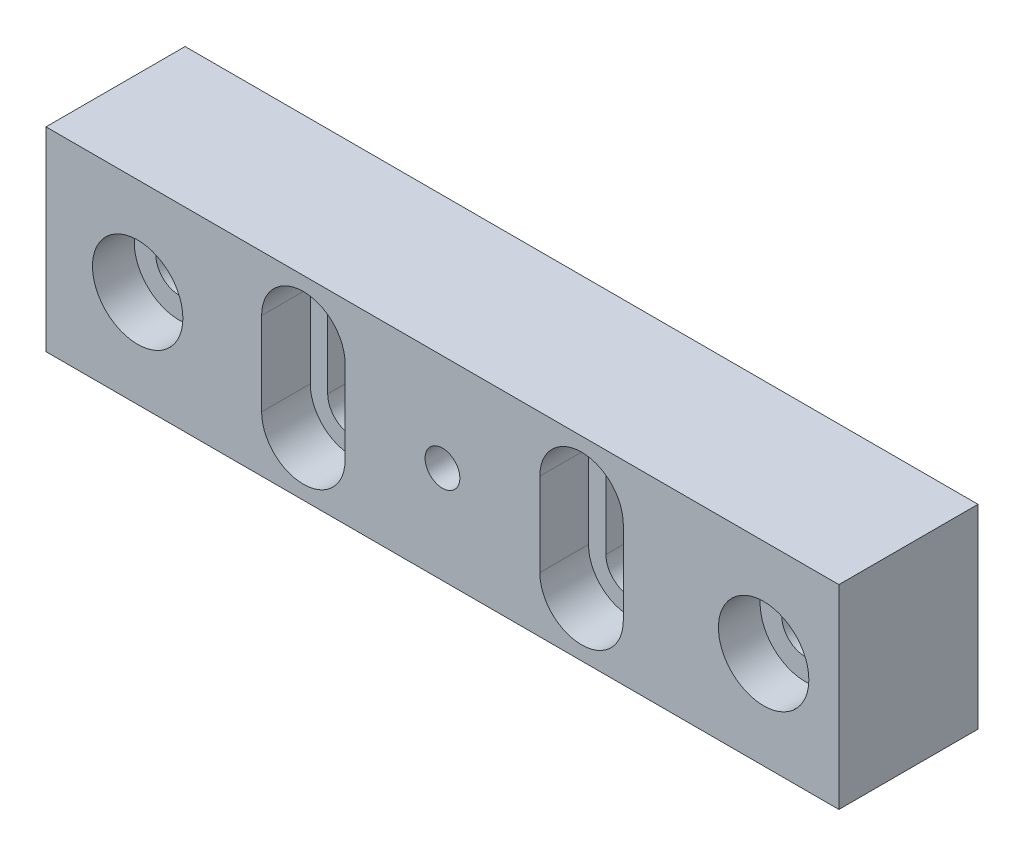
ISO-10303-21;
HEADER;
FILE_DESCRIPTION(('STEP AP214'),'2;1');
FILE_NAME('part.step','',(''),(''),'','','');
FILE_SCHEMA(('AUTOMOTIVE_DESIGN { 1 0 10303 214 1 1 1 1 }'));
ENDSEC;
DATA;
#1=APPLICATION_CONTEXT('core data for automotive mechanical design processes');
#2=APPLICATION_PROTOCOL_DEFINITION('international standard','automotive_design',2000,#1);
#3=PRODUCT_CONTEXT('',#1,'mechanical');
#4=PRODUCT('Part','Part','',(#3));
#5=PRODUCT_RELATED_PRODUCT_CATEGORY('part','',(#4));
#6=PRODUCT_DEFINITION_FORMATION('','',#4);
#7=PRODUCT_DEFINITION_CONTEXT('part definition',#1,'design');
#8=PRODUCT_DEFINITION('design','',#6,#7);
#9=PRODUCT_DEFINITION_SHAPE('','',#8);
#10=(LENGTH_UNIT() NAMED_UNIT(*) SI_UNIT(.MILLI.,.METRE.));
#11=(NAMED_UNIT(*) PLANE_ANGLE_UNIT() SI_UNIT($,.RADIAN.));
#12=(NAMED_UNIT(*) SI_UNIT($,.STERADIAN.) SOLID_ANGLE_UNIT());
#13=UNCERTAINTY_MEASURE_WITH_UNIT(LENGTH_MEASURE(1.E-05),#10,'distance_accuracy_value','');
#14=(GEOMETRIC_REPRESENTATION_CONTEXT(3) GLOBAL_UNCERTAINTY_ASSIGNED_CONTEXT((#13)) GLOBAL_UNIT_ASSIGNED_CONTEXT((#10,
#11,#12)) REPRESENTATION_CONTEXT('',''));
#15=CARTESIAN_POINT('',(0.,0.,0.));
#16=DIRECTION('',(0.,0.,1.));
#17=DIRECTION('',(1.,0.,0.));
#18=AXIS2_PLACEMENT_3D('',#15,#16,#17);
#19=CARTESIAN_POINT('',(28.5,-7.,10.));
#20=DIRECTION('',(-1.,0.,0.));
#21=DIRECTION('',(0.,0.,1.));
#22=AXIS2_PLACEMENT_3D('',#19,#20,#21);
#23=PLANE('',#22);
#24=DIRECTION('',(0.,1.,0.));
#25=VECTOR('',#24,1.);
#26=CARTESIAN_POINT('',(28.5,-7.,0.));
#27=LINE('',#26,#25);
#28=CARTESIAN_POINT('',(28.5,-7.,0.));
#29=VERTEX_POINT('',#28);
#30=CARTESIAN_POINT('',(28.5,7.,0.));
#31=VERTEX_POINT('',#30);
#32=EDGE_CURVE('E275',#29,#31,#27,.T.);
#33=ORIENTED_EDGE('',*,*,#32,.T.);
#34=DIRECTION('',(0.,0.,-1.));
#35=VECTOR('',#34,1.);
#36=CARTESIAN_POINT('',(28.5,7.,10.));
#37=LINE('',#36,#35);
#38=CARTESIAN_POINT('',(28.5,7.,10.));
#39=VERTEX_POINT('',#38);
#40=EDGE_CURVE('E11',#39,#31,#37,.T.);
#41=ORIENTED_EDGE('',*,*,#40,.F.);
#42=DIRECTION('',(0.,1.,0.));
#43=VECTOR('',#42,1.);
#44=CARTESIAN_POINT('',(28.5,-7.,10.));
#45=LINE('',#44,#43);
#46=CARTESIAN_POINT('',(28.5,-7.,10.));
#47=VERTEX_POINT('',#46);
#48=EDGE_CURVE('E312',#47,#39,#45,.T.);
#49=ORIENTED_EDGE('',*,*,#48,.F.);
#50=DIRECTION('',(0.,0.,-1.));
#51=VECTOR('',#50,1.);
#52=CARTESIAN_POINT('',(28.5,-7.,10.));
#53=LINE('',#52,#51);
#54=EDGE_CURVE('E322',#47,#29,#53,.T.);
#55=ORIENTED_EDGE('',*,*,#54,.T.);
#56=EDGE_LOOP('',(#33,#41,#49,#55));
#57=FACE_BOUND('',#56,.T.);
#58=ADVANCED_FACE('F37',(#57),#23,.F.);
#59=CARTESIAN_POINT('',(-28.5,7.,10.));
#60=DIRECTION('',(0.,-1.,0.));
#61=DIRECTION('',(0.,0.,-1.));
#62=AXIS2_PLACEMENT_3D('',#59,#60,#61);
#63=PLANE('',#62);
#64=DIRECTION('',(-1.,0.,0.));
#65=VECTOR('',#64,1.);
#66=CARTESIAN_POINT('',(-28.5,7.,0.));
#67=LINE('',#66,#65);
#68=CARTESIAN_POINT('',(-28.5,7.,0.));
#69=VERTEX_POINT('',#68);
#70=EDGE_CURVE('E325',#31,#69,#67,.T.);
#71=ORIENTED_EDGE('',*,*,#70,.T.);
#72=DIRECTION('',(0.,0.,-1.));
#73=VECTOR('',#72,1.);
#74=CARTESIAN_POINT('',(-28.5,7.,10.));
#75=LINE('',#74,#73);
#76=CARTESIAN_POINT('',(-28.5,7.,10.));
#77=VERTEX_POINT('',#76);
#78=EDGE_CURVE('E44',#77,#69,#75,.T.);
#79=ORIENTED_EDGE('',*,*,#78,.F.);
#80=DIRECTION('',(-1.,0.,0.));
#81=VECTOR('',#80,1.);
#82=CARTESIAN_POINT('',(-28.5,7.,10.));
#83=LINE('',#82,#81);
#84=EDGE_CURVE('E315',#39,#77,#83,.T.);
#85=ORIENTED_EDGE('',*,*,#84,.F.);
#86=ORIENTED_EDGE('',*,*,#40,.T.);
#87=EDGE_LOOP('',(#71,#79,#85,#86));
#88=FACE_BOUND('',#87,.T.);
#89=ADVANCED_FACE('F354',(#88),#63,.F.);
#90=CARTESIAN_POINT('',(-28.5,-7.,10.));
#91=DIRECTION('',(1.,0.,0.));
#92=DIRECTION('',(0.,0.,-1.));
#93=AXIS2_PLACEMENT_3D('',#90,#91,#92);
#94=PLANE('',#93);
#95=DIRECTION('',(0.,-1.,0.));
#96=VECTOR('',#95,1.);
#97=CARTESIAN_POINT('',(-28.5,-7.,0.));
#98=LINE('',#97,#96);
#99=CARTESIAN_POINT('',(-28.5,-7.,0.));
#100=VERTEX_POINT('',#99);
#101=EDGE_CURVE('E327',#69,#100,#98,.T.);
#102=ORIENTED_EDGE('',*,*,#101,.T.);
#103=DIRECTION('',(0.,0.,-1.));
#104=VECTOR('',#103,1.);
#105=CARTESIAN_POINT('',(-28.5,-7.,10.));
#106=LINE('',#105,#104);
#107=CARTESIAN_POINT('',(-28.5,-7.,10.));
#108=VERTEX_POINT('',#107);
#109=EDGE_CURVE('E332',#108,#100,#106,.T.);
#110=ORIENTED_EDGE('',*,*,#109,.F.);
#111=DIRECTION('',(0.,-1.,0.));
#112=VECTOR('',#111,1.);
#113=CARTESIAN_POINT('',(-28.5,-7.,10.));
#114=LINE('',#113,#112);
#115=EDGE_CURVE('E318',#77,#108,#114,.T.);
#116=ORIENTED_EDGE('',*,*,#115,.F.);
#117=ORIENTED_EDGE('',*,*,#78,.T.);
#118=EDGE_LOOP('',(#102,#110,#116,#117));
#119=FACE_BOUND('',#118,.T.);
#120=ADVANCED_FACE('F339',(#119),#94,.F.);
#121=CARTESIAN_POINT('',(-28.5,-7.,10.));
#122=DIRECTION('',(0.,1.,0.));
#123=DIRECTION('',(0.,0.,1.));
#124=AXIS2_PLACEMENT_3D('',#121,#122,#123);
#125=PLANE('',#124);
#126=DIRECTION('',(1.,0.,0.));
#127=VECTOR('',#126,1.);
#128=CARTESIAN_POINT('',(-28.5,-7.,0.));
#129=LINE('',#128,#127);
#130=EDGE_CURVE('E316',#100,#29,#129,.T.);
#131=ORIENTED_EDGE('',*,*,#130,.T.);
#132=ORIENTED_EDGE('',*,*,#54,.F.);
#133=DIRECTION('',(1.,0.,0.));
#134=VECTOR('',#133,1.);
#135=CARTESIAN_POINT('',(-28.5,-7.,10.));
#136=LINE('',#135,#134);
#137=EDGE_CURVE('E320',#108,#47,#136,.T.);
#138=ORIENTED_EDGE('',*,*,#137,.F.);
#139=ORIENTED_EDGE('',*,*,#109,.T.);
#140=EDGE_LOOP('',(#131,#132,#138,#139));
#141=FACE_BOUND('',#140,.T.);
#142=ADVANCED_FACE('F347',(#141),#125,.F.);
#143=CARTESIAN_POINT('',(0.,0.,10.));
#144=DIRECTION('',(0.,0.,-1.));
#145=DIRECTION('',(-1.,0.,0.));
#146=AXIS2_PLACEMENT_3D('',#143,#144,#145);
#147=PLANE('',#146);
#148=CARTESIAN_POINT('',(0.,0.,10.));
#149=DIRECTION('',(0.,0.,1.));
#150=DIRECTION('',(1.,0.,0.));
#151=AXIS2_PLACEMENT_3D('',#148,#149,#150);
#152=CIRCLE('',#151,1.25);
#153=CARTESIAN_POINT('',(1.25,0.,10.));
#154=VERTEX_POINT('',#153);
#155=EDGE_CURVE('E471',#154,#154,#152,.T.);
#156=ORIENTED_EDGE('',*,*,#155,.F.);
#157=EDGE_LOOP('',(#156));
#158=FACE_BOUND('',#157,.T.);
#159=CARTESIAN_POINT('',(23.0899724315778,0.,10.));
#160=DIRECTION('',(0.,0.,1.));
#161=DIRECTION('',(1.,0.,0.));
#162=AXIS2_PLACEMENT_3D('',#159,#160,#161);
#163=CIRCLE('',#162,3.25);
#164=CARTESIAN_POINT('',(26.3399724315778,0.,10.));
#165=VERTEX_POINT('',#164);
#166=EDGE_CURVE('E473',#165,#165,#163,.T.);
#167=ORIENTED_EDGE('',*,*,#166,.F.);
#168=EDGE_LOOP('',(#167));
#169=FACE_BOUND('',#168,.T.);
#170=CARTESIAN_POINT('',(-21.9100275684222,0.,10.));
#171=DIRECTION('',(0.,0.,1.));
#172=DIRECTION('',(1.,0.,0.));
#173=AXIS2_PLACEMENT_3D('',#170,#171,#172);
#174=CIRCLE('',#173,3.25);
#175=CARTESIAN_POINT('',(-18.6600275684222,0.,10.));
#176=VERTEX_POINT('',#175);
#177=EDGE_CURVE('E487',#176,#176,#174,.T.);
#178=ORIENTED_EDGE('',*,*,#177,.F.);
#179=EDGE_LOOP('',(#178));
#180=FACE_BOUND('',#179,.T.);
#181=DIRECTION('',(0.,-1.,0.));
#182=VECTOR('',#181,1.);
#183=CARTESIAN_POINT('',(-13.,3.,10.));
#184=LINE('',#183,#182);
#185=CARTESIAN_POINT('',(-13.,3.,10.));
#186=VERTEX_POINT('',#185);
#187=CARTESIAN_POINT('',(-13.,-3.,10.));
#188=VERTEX_POINT('',#187);
#189=EDGE_CURVE('E264',#186,#188,#184,.T.);
#190=ORIENTED_EDGE('',*,*,#189,.F.);
#191=CARTESIAN_POINT('',(-10.,3.,10.));
#192=DIRECTION('',(0.,0.,1.));
#193=DIRECTION('',(1.,0.,0.));
#194=AXIS2_PLACEMENT_3D('',#191,#192,#193);
#195=CIRCLE('',#194,3.);
#196=CARTESIAN_POINT('',(-7.,3.,10.));
#197=VERTEX_POINT('',#196);
#198=EDGE_CURVE('E262',#197,#186,#195,.T.);
#199=ORIENTED_EDGE('',*,*,#198,.F.);
#200=DIRECTION('',(0.,1.,0.));
#201=VECTOR('',#200,1.);
#202=CARTESIAN_POINT('',(-7.,3.,10.));
#203=LINE('',#202,#201);
#204=CARTESIAN_POINT('',(-7.,-3.,10.));
#205=VERTEX_POINT('',#204);
#206=EDGE_CURVE('E252',#205,#197,#203,.T.);
#207=ORIENTED_EDGE('',*,*,#206,.F.);
#208=CARTESIAN_POINT('',(-10.,-3.,10.));
#209=DIRECTION('',(0.,0.,1.));
#210=DIRECTION('',(1.,0.,0.));
#211=AXIS2_PLACEMENT_3D('',#208,#209,#210);
#212=CIRCLE('',#211,3.);
#213=EDGE_CURVE('E268',#188,#205,#212,.T.);
#214=ORIENTED_EDGE('',*,*,#213,.F.);
#215=EDGE_LOOP('',(#190,#199,#207,#214));
#216=FACE_BOUND('',#215,.T.);
#217=DIRECTION('',(0.,-1.,0.));
#218=VECTOR('',#217,1.);
#219=CARTESIAN_POINT('',(7.00000000000003,3.,10.));
#220=LINE('',#219,#218);
#221=CARTESIAN_POINT('',(7.00000000000003,3.,10.));
#222=VERTEX_POINT('',#221);
#223=CARTESIAN_POINT('',(7.00000000000003,-3.,10.));
#224=VERTEX_POINT('',#223);
#225=EDGE_CURVE('E297',#222,#224,#220,.T.);
#226=ORIENTED_EDGE('',*,*,#225,.F.);
#227=CARTESIAN_POINT('',(10.,3.,10.));
#228=DIRECTION('',(0.,0.,1.));
#229=DIRECTION('',(1.,0.,0.));
#230=AXIS2_PLACEMENT_3D('',#227,#228,#229);
#231=CIRCLE('',#230,3.);
#232=CARTESIAN_POINT('',(13.,3.,10.));
#233=VERTEX_POINT('',#232);
#234=EDGE_CURVE('E215',#233,#222,#231,.T.);
#235=ORIENTED_EDGE('',*,*,#234,.F.);
#236=DIRECTION('',(0.,1.,0.));
#237=VECTOR('',#236,1.);
#238=CARTESIAN_POINT('',(13.,3.,10.));
#239=LINE('',#238,#237);
#240=CARTESIAN_POINT('',(13.,-3.,10.));
#241=VERTEX_POINT('',#240);
#242=EDGE_CURVE('E286',#241,#233,#239,.T.);
#243=ORIENTED_EDGE('',*,*,#242,.F.);
#244=CARTESIAN_POINT('',(10.,-3.,10.));
#245=DIRECTION('',(0.,0.,1.));
#246=DIRECTION('',(1.,0.,0.));
#247=AXIS2_PLACEMENT_3D('',#244,#245,#246);
#248=CIRCLE('',#247,3.);
#249=EDGE_CURVE('E300',#224,#241,#248,.T.);
#250=ORIENTED_EDGE('',*,*,#249,.F.);
#251=EDGE_LOOP('',(#226,#235,#243,#250));
#252=FACE_BOUND('',#251,.T.);
#253=ORIENTED_EDGE('',*,*,#48,.T.);
#254=ORIENTED_EDGE('',*,*,#84,.T.);
#255=ORIENTED_EDGE('',*,*,#115,.T.);
#256=ORIENTED_EDGE('',*,*,#137,.T.);
#257=EDGE_LOOP('',(#253,#254,#255,#256));
#258=FACE_BOUND('',#257,.T.);
#259=ADVANCED_FACE('F353',(#158,#169,#180,#216,#252,#258),#147,.F.);
#260=CARTESIAN_POINT('',(0.,0.,0.));
#261=DIRECTION('',(0.,0.,-1.));
#262=DIRECTION('',(-1.,0.,0.));
#263=AXIS2_PLACEMENT_3D('',#260,#261,#262);
#264=PLANE('',#263);
#265=CARTESIAN_POINT('',(0.,0.,0.));
#266=DIRECTION('',(0.,0.,1.));
#267=DIRECTION('',(1.,0.,0.));
#268=AXIS2_PLACEMENT_3D('',#265,#266,#267);
#269=CIRCLE('',#268,1.25);
#270=CARTESIAN_POINT('',(1.25,0.,0.));
#271=VERTEX_POINT('',#270);
#272=EDGE_CURVE('E468',#271,#271,#269,.T.);
#273=ORIENTED_EDGE('',*,*,#272,.T.);
#274=EDGE_LOOP('',(#273));
#275=FACE_BOUND('',#274,.T.);
#276=CARTESIAN_POINT('',(23.0899724315778,0.,0.));
#277=DIRECTION('',(0.,0.,1.));
#278=DIRECTION('',(1.,0.,0.));
#279=AXIS2_PLACEMENT_3D('',#276,#277,#278);
#280=CIRCLE('',#279,1.7);
#281=CARTESIAN_POINT('',(24.7899724315778,0.,0.));
#282=VERTEX_POINT('',#281);
#283=EDGE_CURVE('E478',#282,#282,#280,.T.);
#284=ORIENTED_EDGE('',*,*,#283,.T.);
#285=EDGE_LOOP('',(#284));
#286=FACE_BOUND('',#285,.T.);
#287=CARTESIAN_POINT('',(-21.9100275684222,0.,0.));
#288=DIRECTION('',(0.,0.,1.));
#289=DIRECTION('',(1.,0.,0.));
#290=AXIS2_PLACEMENT_3D('',#287,#288,#289);
#291=CIRCLE('',#290,1.7);
#292=CARTESIAN_POINT('',(-20.2100275684222,0.,0.));
#293=VERTEX_POINT('',#292);
#294=EDGE_CURVE('E203',#293,#293,#291,.T.);
#295=ORIENTED_EDGE('',*,*,#294,.T.);
#296=EDGE_LOOP('',(#295));
#297=FACE_BOUND('',#296,.T.);
#298=CARTESIAN_POINT('',(-10.,3.,0.));
#299=DIRECTION('',(0.,0.,1.));
#300=DIRECTION('',(1.,0.,0.));
#301=AXIS2_PLACEMENT_3D('',#298,#299,#300);
#302=CIRCLE('',#301,1.75);
#303=CARTESIAN_POINT('',(-8.25,3.,0.));
#304=VERTEX_POINT('',#303);
#305=CARTESIAN_POINT('',(-11.75,3.,0.));
#306=VERTEX_POINT('',#305);
#307=EDGE_CURVE('E177',#304,#306,#302,.T.);
#308=ORIENTED_EDGE('',*,*,#307,.T.);
#309=DIRECTION('',(0.,-1.,0.));
#310=VECTOR('',#309,1.);
#311=CARTESIAN_POINT('',(-11.75,3.,0.));
#312=LINE('',#311,#310);
#313=CARTESIAN_POINT('',(-11.75,-3.,0.));
#314=VERTEX_POINT('',#313);
#315=EDGE_CURVE('E189',#306,#314,#312,.T.);
#316=ORIENTED_EDGE('',*,*,#315,.T.);
#317=CARTESIAN_POINT('',(-10.,-3.,0.));
#318=DIRECTION('',(0.,0.,1.));
#319=DIRECTION('',(1.,0.,0.));
#320=AXIS2_PLACEMENT_3D('',#317,#318,#319);
#321=CIRCLE('',#320,1.75);
#322=CARTESIAN_POINT('',(-8.25,-3.,0.));
#323=VERTEX_POINT('',#322);
#324=EDGE_CURVE('E193',#314,#323,#321,.T.);
#325=ORIENTED_EDGE('',*,*,#324,.T.);
#326=DIRECTION('',(0.,1.,0.));
#327=VECTOR('',#326,1.);
#328=CARTESIAN_POINT('',(-8.25,-3.,0.));
#329=LINE('',#328,#327);
#330=EDGE_CURVE('E185',#323,#304,#329,.T.);
#331=ORIENTED_EDGE('',*,*,#330,.T.);
#332=EDGE_LOOP('',(#308,#316,#325,#331));
#333=FACE_BOUND('',#332,.T.);
#334=CARTESIAN_POINT('',(10.,-3.,0.));
#335=DIRECTION('',(0.,0.,1.));
#336=DIRECTION('',(1.,0.,0.));
#337=AXIS2_PLACEMENT_3D('',#334,#335,#336);
#338=CIRCLE('',#337,1.75);
#339=CARTESIAN_POINT('',(8.25000000000003,-3.,0.));
#340=VERTEX_POINT('',#339);
#341=CARTESIAN_POINT('',(11.75,-3.,0.));
#342=VERTEX_POINT('',#341);
#343=EDGE_CURVE('E219',#340,#342,#338,.T.);
#344=ORIENTED_EDGE('',*,*,#343,.T.);
#345=DIRECTION('',(0.,1.,0.));
#346=VECTOR('',#345,1.);
#347=CARTESIAN_POINT('',(11.75,-3.,0.));
#348=LINE('',#347,#346);
#349=CARTESIAN_POINT('',(11.75,3.,0.));
#350=VERTEX_POINT('',#349);
#351=EDGE_CURVE('E222',#342,#350,#348,.T.);
#352=ORIENTED_EDGE('',*,*,#351,.T.);
#353=CARTESIAN_POINT('',(10.,3.,0.));
#354=DIRECTION('',(0.,0.,1.));
#355=DIRECTION('',(1.,0.,0.));
#356=AXIS2_PLACEMENT_3D('',#353,#354,#355);
#357=CIRCLE('',#356,1.75);
#358=CARTESIAN_POINT('',(8.25000000000003,3.,0.));
#359=VERTEX_POINT('',#358);
#360=EDGE_CURVE('E226',#350,#359,#357,.T.);
#361=ORIENTED_EDGE('',*,*,#360,.T.);
#362=DIRECTION('',(0.,-1.,0.));
#363=VECTOR('',#362,1.);
#364=CARTESIAN_POINT('',(8.25000000000003,3.,0.));
#365=LINE('',#364,#363);
#366=EDGE_CURVE('E229',#359,#340,#365,.T.);
#367=ORIENTED_EDGE('',*,*,#366,.T.);
#368=EDGE_LOOP('',(#344,#352,#361,#367));
#369=FACE_BOUND('',#368,.T.);
#370=ORIENTED_EDGE('',*,*,#32,.F.);
#371=ORIENTED_EDGE('',*,*,#130,.F.);
#372=ORIENTED_EDGE('',*,*,#101,.F.);
#373=ORIENTED_EDGE('',*,*,#70,.F.);
#374=EDGE_LOOP('',(#370,#371,#372,#373));
#375=FACE_BOUND('',#374,.T.);
#376=ADVANCED_FACE('F195',(#275,#286,#297,#333,#369,#375),#264,.T.);
#377=CARTESIAN_POINT('',(10.,3.,6.5));
#378=DIRECTION('',(0.,0.,1.));
#379=DIRECTION('',(1.,0.,0.));
#380=AXIS2_PLACEMENT_3D('',#377,#378,#379);
#381=CYLINDRICAL_SURFACE('',#380,3.);
#382=ORIENTED_EDGE('',*,*,#234,.T.);
#383=DIRECTION('',(0.,0.,1.));
#384=VECTOR('',#383,1.);
#385=CARTESIAN_POINT('',(7.00000000000003,3.,6.5));
#386=LINE('',#385,#384);
#387=CARTESIAN_POINT('',(7.00000000000003,3.,6.5));
#388=VERTEX_POINT('',#387);
#389=EDGE_CURVE('E295',#388,#222,#386,.T.);
#390=ORIENTED_EDGE('',*,*,#389,.F.);
#391=CARTESIAN_POINT('',(10.,3.,6.5));
#392=DIRECTION('',(0.,0.,1.));
#393=DIRECTION('',(1.,0.,0.));
#394=AXIS2_PLACEMENT_3D('',#391,#392,#393);
#395=CIRCLE('',#394,3.);
#396=CARTESIAN_POINT('',(13.,3.,6.5));
#397=VERTEX_POINT('',#396);
#398=EDGE_CURVE('E282',#397,#388,#395,.T.);
#399=ORIENTED_EDGE('',*,*,#398,.F.);
#400=DIRECTION('',(0.,0.,1.));
#401=VECTOR('',#400,1.);
#402=CARTESIAN_POINT('',(13.,3.,6.5));
#403=LINE('',#402,#401);
#404=EDGE_CURVE('E265',#397,#233,#403,.T.);
#405=ORIENTED_EDGE('',*,*,#404,.T.);
#406=EDGE_LOOP('',(#382,#390,#399,#405));
#407=FACE_BOUND('',#406,.T.);
#408=ADVANCED_FACE('F366',(#407),#381,.F.);
#409=CARTESIAN_POINT('',(13.,3.,6.5));
#410=DIRECTION('',(1.,0.,0.));
#411=DIRECTION('',(0.,0.,-1.));
#412=AXIS2_PLACEMENT_3D('',#409,#410,#411);
#413=PLANE('',#412);
#414=ORIENTED_EDGE('',*,*,#242,.T.);
#415=ORIENTED_EDGE('',*,*,#404,.F.);
#416=DIRECTION('',(0.,1.,0.));
#417=VECTOR('',#416,1.);
#418=CARTESIAN_POINT('',(13.,3.,6.5));
#419=LINE('',#418,#417);
#420=CARTESIAN_POINT('',(13.,-3.,6.5));
#421=VERTEX_POINT('',#420);
#422=EDGE_CURVE('E292',#421,#397,#419,.T.);
#423=ORIENTED_EDGE('',*,*,#422,.F.);
#424=DIRECTION('',(0.,0.,1.));
#425=VECTOR('',#424,1.);
#426=CARTESIAN_POINT('',(13.,-3.,6.5));
#427=LINE('',#426,#425);
#428=EDGE_CURVE('E306',#421,#241,#427,.T.);
#429=ORIENTED_EDGE('',*,*,#428,.T.);
#430=EDGE_LOOP('',(#414,#415,#423,#429));
#431=FACE_BOUND('',#430,.T.);
#432=ADVANCED_FACE('F373',(#431),#413,.F.);
#433=CARTESIAN_POINT('',(10.,-3.,6.5));
#434=DIRECTION('',(0.,0.,1.));
#435=DIRECTION('',(1.,0.,0.));
#436=AXIS2_PLACEMENT_3D('',#433,#434,#435);
#437=CYLINDRICAL_SURFACE('',#436,3.);
#438=ORIENTED_EDGE('',*,*,#249,.T.);
#439=ORIENTED_EDGE('',*,*,#428,.F.);
#440=CARTESIAN_POINT('',(10.,-3.,6.5));
#441=DIRECTION('',(0.,0.,1.));
#442=DIRECTION('',(1.,0.,0.));
#443=AXIS2_PLACEMENT_3D('',#440,#441,#442);
#444=CIRCLE('',#443,3.);
#445=CARTESIAN_POINT('',(7.00000000000003,-3.,6.5));
#446=VERTEX_POINT('',#445);
#447=EDGE_CURVE('E289',#446,#421,#444,.T.);
#448=ORIENTED_EDGE('',*,*,#447,.F.);
#449=DIRECTION('',(0.,0.,1.));
#450=VECTOR('',#449,1.);
#451=CARTESIAN_POINT('',(7.00000000000003,-3.,6.5));
#452=LINE('',#451,#450);
#453=EDGE_CURVE('E308',#446,#224,#452,.T.);
#454=ORIENTED_EDGE('',*,*,#453,.T.);
#455=EDGE_LOOP('',(#438,#439,#448,#454));
#456=FACE_BOUND('',#455,.T.);
#457=ADVANCED_FACE('F379',(#456),#437,.F.);
#458=CARTESIAN_POINT('',(7.00000000000003,3.,6.5));
#459=DIRECTION('',(-1.,0.,0.));
#460=DIRECTION('',(0.,0.,1.));
#461=AXIS2_PLACEMENT_3D('',#458,#459,#460);
#462=PLANE('',#461);
#463=ORIENTED_EDGE('',*,*,#225,.T.);
#464=ORIENTED_EDGE('',*,*,#453,.F.);
#465=DIRECTION('',(0.,-1.,0.));
#466=VECTOR('',#465,1.);
#467=CARTESIAN_POINT('',(7.00000000000003,3.,6.5));
#468=LINE('',#467,#466);
#469=EDGE_CURVE('E285',#388,#446,#468,.T.);
#470=ORIENTED_EDGE('',*,*,#469,.F.);
#471=ORIENTED_EDGE('',*,*,#389,.T.);
#472=EDGE_LOOP('',(#463,#464,#470,#471));
#473=FACE_BOUND('',#472,.T.);
#474=ADVANCED_FACE('F375',(#473),#462,.F.);
#475=CARTESIAN_POINT('',(10.,3.,6.5));
#476=DIRECTION('',(0.,0.,1.));
#477=DIRECTION('',(1.,0.,0.));
#478=AXIS2_PLACEMENT_3D('',#475,#476,#477);
#479=PLANE('',#478);
#480=CARTESIAN_POINT('',(10.,-3.,6.5));
#481=DIRECTION('',(0.,0.,1.));
#482=DIRECTION('',(1.,0.,0.));
#483=AXIS2_PLACEMENT_3D('',#480,#481,#482);
#484=CIRCLE('',#483,1.75);
#485=CARTESIAN_POINT('',(8.25000000000003,-3.,6.5));
#486=VERTEX_POINT('',#485);
#487=CARTESIAN_POINT('',(11.75,-3.,6.5));
#488=VERTEX_POINT('',#487);
#489=EDGE_CURVE('E233',#486,#488,#484,.T.);
#490=ORIENTED_EDGE('',*,*,#489,.F.);
#491=DIRECTION('',(0.,-1.,0.));
#492=VECTOR('',#491,1.);
#493=CARTESIAN_POINT('',(8.25000000000003,3.,6.5));
#494=LINE('',#493,#492);
#495=CARTESIAN_POINT('',(8.25000000000003,3.,6.5));
#496=VERTEX_POINT('',#495);
#497=EDGE_CURVE('E223',#496,#486,#494,.T.);
#498=ORIENTED_EDGE('',*,*,#497,.F.);
#499=CARTESIAN_POINT('',(10.,3.,6.5));
#500=DIRECTION('',(0.,0.,1.));
#501=DIRECTION('',(1.,0.,0.));
#502=AXIS2_PLACEMENT_3D('',#499,#500,#501);
#503=CIRCLE('',#502,1.75);
#504=CARTESIAN_POINT('',(11.75,3.,6.5));
#505=VERTEX_POINT('',#504);
#506=EDGE_CURVE('E51',#505,#496,#503,.T.);
#507=ORIENTED_EDGE('',*,*,#506,.F.);
#508=DIRECTION('',(0.,1.,0.));
#509=VECTOR('',#508,1.);
#510=CARTESIAN_POINT('',(11.75,-3.,6.5));
#511=LINE('',#510,#509);
#512=EDGE_CURVE('E236',#488,#505,#511,.T.);
#513=ORIENTED_EDGE('',*,*,#512,.F.);
#514=EDGE_LOOP('',(#490,#498,#507,#513));
#515=FACE_BOUND('',#514,.T.);
#516=ORIENTED_EDGE('',*,*,#398,.T.);
#517=ORIENTED_EDGE('',*,*,#469,.T.);
#518=ORIENTED_EDGE('',*,*,#447,.T.);
#519=ORIENTED_EDGE('',*,*,#422,.T.);
#520=EDGE_LOOP('',(#516,#517,#518,#519));
#521=FACE_BOUND('',#520,.T.);
#522=ADVANCED_FACE('F378',(#515,#521),#479,.T.);
#523=CARTESIAN_POINT('',(-10.,3.,6.5));
#524=DIRECTION('',(0.,0.,1.));
#525=DIRECTION('',(1.,0.,0.));
#526=AXIS2_PLACEMENT_3D('',#523,#524,#525);
#527=CYLINDRICAL_SURFACE('',#526,3.);
#528=ORIENTED_EDGE('',*,*,#198,.T.);
#529=DIRECTION('',(0.,0.,1.));
#530=VECTOR('',#529,1.);
#531=CARTESIAN_POINT('',(-13.,3.,6.5));
#532=LINE('',#531,#530);
#533=CARTESIAN_POINT('',(-13.,3.,6.5));
#534=VERTEX_POINT('',#533);
#535=EDGE_CURVE('E261',#534,#186,#532,.T.);
#536=ORIENTED_EDGE('',*,*,#535,.F.);
#537=CARTESIAN_POINT('',(-10.,3.,6.5));
#538=DIRECTION('',(0.,0.,1.));
#539=DIRECTION('',(1.,0.,0.));
#540=AXIS2_PLACEMENT_3D('',#537,#538,#539);
#541=CIRCLE('',#540,3.);
#542=CARTESIAN_POINT('',(-7.,3.,6.5));
#543=VERTEX_POINT('',#542);
#544=EDGE_CURVE('E248',#543,#534,#541,.T.);
#545=ORIENTED_EDGE('',*,*,#544,.F.);
#546=DIRECTION('',(0.,0.,1.));
#547=VECTOR('',#546,1.);
#548=CARTESIAN_POINT('',(-7.,3.,6.5));
#549=LINE('',#548,#547);
#550=EDGE_CURVE('E273',#543,#197,#549,.T.);
#551=ORIENTED_EDGE('',*,*,#550,.T.);
#552=EDGE_LOOP('',(#528,#536,#545,#551));
#553=FACE_BOUND('',#552,.T.);
#554=ADVANCED_FACE('F389',(#553),#527,.F.);
#555=CARTESIAN_POINT('',(-7.,3.,6.5));
#556=DIRECTION('',(1.,0.,0.));
#557=DIRECTION('',(0.,0.,-1.));
#558=AXIS2_PLACEMENT_3D('',#555,#556,#557);
#559=PLANE('',#558);
#560=ORIENTED_EDGE('',*,*,#206,.T.);
#561=ORIENTED_EDGE('',*,*,#550,.F.);
#562=DIRECTION('',(0.,1.,0.));
#563=VECTOR('',#562,1.);
#564=CARTESIAN_POINT('',(-7.,3.,6.5));
#565=LINE('',#564,#563);
#566=CARTESIAN_POINT('',(-7.,-3.,6.5));
#567=VERTEX_POINT('',#566);
#568=EDGE_CURVE('E258',#567,#543,#565,.T.);
#569=ORIENTED_EDGE('',*,*,#568,.F.);
#570=DIRECTION('',(0.,0.,1.));
#571=VECTOR('',#570,1.);
#572=CARTESIAN_POINT('',(-7.,-3.,6.5));
#573=LINE('',#572,#571);
#574=EDGE_CURVE('E276',#567,#205,#573,.T.);
#575=ORIENTED_EDGE('',*,*,#574,.T.);
#576=EDGE_LOOP('',(#560,#561,#569,#575));
#577=FACE_BOUND('',#576,.T.);
#578=ADVANCED_FACE('F393',(#577),#559,.F.);
#579=CARTESIAN_POINT('',(-10.,-3.,6.5));
#580=DIRECTION('',(0.,0.,1.));
#581=DIRECTION('',(1.,0.,0.));
#582=AXIS2_PLACEMENT_3D('',#579,#580,#581);
#583=CYLINDRICAL_SURFACE('',#582,3.);
#584=ORIENTED_EDGE('',*,*,#213,.T.);
#585=ORIENTED_EDGE('',*,*,#574,.F.);
#586=CARTESIAN_POINT('',(-10.,-3.,6.5));
#587=DIRECTION('',(0.,0.,1.));
#588=DIRECTION('',(1.,0.,0.));
#589=AXIS2_PLACEMENT_3D('',#586,#587,#588);
#590=CIRCLE('',#589,3.);
#591=CARTESIAN_POINT('',(-13.,-3.,6.5));
#592=VERTEX_POINT('',#591);
#593=EDGE_CURVE('E255',#592,#567,#590,.T.);
#594=ORIENTED_EDGE('',*,*,#593,.F.);
#595=DIRECTION('',(0.,0.,1.));
#596=VECTOR('',#595,1.);
#597=CARTESIAN_POINT('',(-13.,-3.,6.5));
#598=LINE('',#597,#596);
#599=EDGE_CURVE('E278',#592,#188,#598,.T.);
#600=ORIENTED_EDGE('',*,*,#599,.T.);
#601=EDGE_LOOP('',(#584,#585,#594,#600));
#602=FACE_BOUND('',#601,.T.);
#603=ADVANCED_FACE('F399',(#602),#583,.F.);
#604=CARTESIAN_POINT('',(-13.,3.,6.5));
#605=DIRECTION('',(-1.,0.,0.));
#606=DIRECTION('',(0.,0.,1.));
#607=AXIS2_PLACEMENT_3D('',#604,#605,#606);
#608=PLANE('',#607);
#609=ORIENTED_EDGE('',*,*,#189,.T.);
#610=ORIENTED_EDGE('',*,*,#599,.F.);
#611=DIRECTION('',(0.,-1.,0.));
#612=VECTOR('',#611,1.);
#613=CARTESIAN_POINT('',(-13.,3.,6.5));
#614=LINE('',#613,#612);
#615=EDGE_CURVE('E251',#534,#592,#614,.T.);
#616=ORIENTED_EDGE('',*,*,#615,.F.);
#617=ORIENTED_EDGE('',*,*,#535,.T.);
#618=EDGE_LOOP('',(#609,#610,#616,#617));
#619=FACE_BOUND('',#618,.T.);
#620=ADVANCED_FACE('F395',(#619),#608,.F.);
#621=CARTESIAN_POINT('',(-10.,3.,6.5));
#622=DIRECTION('',(0.,0.,1.));
#623=DIRECTION('',(1.,0.,0.));
#624=AXIS2_PLACEMENT_3D('',#621,#622,#623);
#625=PLANE('',#624);
#626=CARTESIAN_POINT('',(-10.,3.,6.5));
#627=DIRECTION('',(0.,0.,1.));
#628=DIRECTION('',(1.,0.,0.));
#629=AXIS2_PLACEMENT_3D('',#626,#627,#628);
#630=CIRCLE('',#629,1.75);
#631=CARTESIAN_POINT('',(-8.25,3.,6.5));
#632=VERTEX_POINT('',#631);
#633=CARTESIAN_POINT('',(-11.75,3.,6.5));
#634=VERTEX_POINT('',#633);
#635=EDGE_CURVE('E180',#632,#634,#630,.T.);
#636=ORIENTED_EDGE('',*,*,#635,.F.);
#637=DIRECTION('',(0.,1.,0.));
#638=VECTOR('',#637,1.);
#639=CARTESIAN_POINT('',(-8.25,-3.,6.5));
#640=LINE('',#639,#638);
#641=CARTESIAN_POINT('',(-8.25,-3.,6.5));
#642=VERTEX_POINT('',#641);
#643=EDGE_CURVE('E198',#642,#632,#640,.T.);
#644=ORIENTED_EDGE('',*,*,#643,.F.);
#645=CARTESIAN_POINT('',(-10.,-3.,6.5));
#646=DIRECTION('',(0.,0.,1.));
#647=DIRECTION('',(1.,0.,0.));
#648=AXIS2_PLACEMENT_3D('',#645,#646,#647);
#649=CIRCLE('',#648,1.75);
#650=CARTESIAN_POINT('',(-11.75,-3.,6.5));
#651=VERTEX_POINT('',#650);
#652=EDGE_CURVE('E59',#651,#642,#649,.T.);
#653=ORIENTED_EDGE('',*,*,#652,.F.);
#654=DIRECTION('',(0.,-1.,0.));
#655=VECTOR('',#654,1.);
#656=CARTESIAN_POINT('',(-11.75,3.,6.5));
#657=LINE('',#656,#655);
#658=EDGE_CURVE('E209',#634,#651,#657,.T.);
#659=ORIENTED_EDGE('',*,*,#658,.F.);
#660=EDGE_LOOP('',(#636,#644,#653,#659));
#661=FACE_BOUND('',#660,.T.);
#662=ORIENTED_EDGE('',*,*,#544,.T.);
#663=ORIENTED_EDGE('',*,*,#615,.T.);
#664=ORIENTED_EDGE('',*,*,#593,.T.);
#665=ORIENTED_EDGE('',*,*,#568,.T.);
#666=EDGE_LOOP('',(#662,#663,#664,#665));
#667=FACE_BOUND('',#666,.T.);
#668=ADVANCED_FACE('F398',(#661,#667),#625,.T.);
#669=CARTESIAN_POINT('',(10.,-3.,0.));
#670=DIRECTION('',(0.,0.,1.));
#671=DIRECTION('',(1.,0.,0.));
#672=AXIS2_PLACEMENT_3D('',#669,#670,#671);
#673=CYLINDRICAL_SURFACE('',#672,1.75);
#674=ORIENTED_EDGE('',*,*,#489,.T.);
#675=DIRECTION('',(0.,0.,1.));
#676=VECTOR('',#675,1.);
#677=CARTESIAN_POINT('',(11.75,-3.,0.));
#678=LINE('',#677,#676);
#679=EDGE_CURVE('E232',#342,#488,#678,.T.);
#680=ORIENTED_EDGE('',*,*,#679,.F.);
#681=ORIENTED_EDGE('',*,*,#343,.F.);
#682=DIRECTION('',(0.,0.,1.));
#683=VECTOR('',#682,1.);
#684=CARTESIAN_POINT('',(8.25000000000003,-3.,0.));
#685=LINE('',#684,#683);
#686=EDGE_CURVE('E210',#340,#486,#685,.T.);
#687=ORIENTED_EDGE('',*,*,#686,.T.);
#688=EDGE_LOOP('',(#674,#680,#681,#687));
#689=FACE_BOUND('',#688,.T.);
#690=ADVANCED_FACE('F409',(#689),#673,.F.);
#691=CARTESIAN_POINT('',(8.25000000000003,3.,0.));
#692=DIRECTION('',(-1.,0.,0.));
#693=DIRECTION('',(0.,0.,1.));
#694=AXIS2_PLACEMENT_3D('',#691,#692,#693);
#695=PLANE('',#694);
#696=ORIENTED_EDGE('',*,*,#497,.T.);
#697=ORIENTED_EDGE('',*,*,#686,.F.);
#698=ORIENTED_EDGE('',*,*,#366,.F.);
#699=DIRECTION('',(0.,0.,1.));
#700=VECTOR('',#699,1.);
#701=CARTESIAN_POINT('',(8.25000000000003,3.,0.));
#702=LINE('',#701,#700);
#703=EDGE_CURVE('E243',#359,#496,#702,.T.);
#704=ORIENTED_EDGE('',*,*,#703,.T.);
#705=EDGE_LOOP('',(#696,#697,#698,#704));
#706=FACE_BOUND('',#705,.T.);
#707=ADVANCED_FACE('F413',(#706),#695,.F.);
#708=CARTESIAN_POINT('',(10.,3.,0.));
#709=DIRECTION('',(0.,0.,1.));
#710=DIRECTION('',(1.,0.,0.));
#711=AXIS2_PLACEMENT_3D('',#708,#709,#710);
#712=CYLINDRICAL_SURFACE('',#711,1.75);
#713=ORIENTED_EDGE('',*,*,#506,.T.);
#714=ORIENTED_EDGE('',*,*,#703,.F.);
#715=ORIENTED_EDGE('',*,*,#360,.F.);
#716=DIRECTION('',(0.,0.,1.));
#717=VECTOR('',#716,1.);
#718=CARTESIAN_POINT('',(11.75,3.,0.));
#719=LINE('',#718,#717);
#720=EDGE_CURVE('E245',#350,#505,#719,.T.);
#721=ORIENTED_EDGE('',*,*,#720,.T.);
#722=EDGE_LOOP('',(#713,#714,#715,#721));
#723=FACE_BOUND('',#722,.T.);
#724=ADVANCED_FACE('F418',(#723),#712,.F.);
#725=CARTESIAN_POINT('',(11.75,-3.,0.));
#726=DIRECTION('',(1.,0.,0.));
#727=DIRECTION('',(0.,0.,-1.));
#728=AXIS2_PLACEMENT_3D('',#725,#726,#727);
#729=PLANE('',#728);
#730=ORIENTED_EDGE('',*,*,#512,.T.);
#731=ORIENTED_EDGE('',*,*,#720,.F.);
#732=ORIENTED_EDGE('',*,*,#351,.F.);
#733=ORIENTED_EDGE('',*,*,#679,.T.);
#734=EDGE_LOOP('',(#730,#731,#732,#733));
#735=FACE_BOUND('',#734,.T.);
#736=ADVANCED_FACE('F415',(#735),#729,.F.);
#737=CARTESIAN_POINT('',(-10.,3.,0.));
#738=DIRECTION('',(0.,0.,1.));
#739=DIRECTION('',(1.,0.,0.));
#740=AXIS2_PLACEMENT_3D('',#737,#738,#739);
#741=CYLINDRICAL_SURFACE('',#740,1.75);
#742=ORIENTED_EDGE('',*,*,#635,.T.);
#743=DIRECTION('',(0.,0.,1.));
#744=VECTOR('',#743,1.);
#745=CARTESIAN_POINT('',(-11.75,3.,0.));
#746=LINE('',#745,#744);
#747=EDGE_CURVE('E173',#306,#634,#746,.T.);
#748=ORIENTED_EDGE('',*,*,#747,.F.);
#749=ORIENTED_EDGE('',*,*,#307,.F.);
#750=DIRECTION('',(0.,0.,1.));
#751=VECTOR('',#750,1.);
#752=CARTESIAN_POINT('',(-8.25,3.,0.));
#753=LINE('',#752,#751);
#754=EDGE_CURVE('E213',#304,#632,#753,.T.);
#755=ORIENTED_EDGE('',*,*,#754,.T.);
#756=EDGE_LOOP('',(#742,#748,#749,#755));
#757=FACE_BOUND('',#756,.T.);
#758=ADVANCED_FACE('F175',(#757),#741,.F.);
#759=CARTESIAN_POINT('',(-8.25,-3.,0.));
#760=DIRECTION('',(1.,0.,0.));
#761=DIRECTION('',(0.,0.,-1.));
#762=AXIS2_PLACEMENT_3D('',#759,#760,#761);
#763=PLANE('',#762);
#764=ORIENTED_EDGE('',*,*,#643,.T.);
#765=ORIENTED_EDGE('',*,*,#754,.F.);
#766=ORIENTED_EDGE('',*,*,#330,.F.);
#767=DIRECTION('',(0.,0.,1.));
#768=VECTOR('',#767,1.);
#769=CARTESIAN_POINT('',(-8.25,-3.,0.));
#770=LINE('',#769,#768);
#771=EDGE_CURVE('E216',#323,#642,#770,.T.);
#772=ORIENTED_EDGE('',*,*,#771,.T.);
#773=EDGE_LOOP('',(#764,#765,#766,#772));
#774=FACE_BOUND('',#773,.T.);
#775=ADVANCED_FACE('F427',(#774),#763,.F.);
#776=CARTESIAN_POINT('',(-10.,-3.,0.));
#777=DIRECTION('',(0.,0.,1.));
#778=DIRECTION('',(1.,0.,0.));
#779=AXIS2_PLACEMENT_3D('',#776,#777,#778);
#780=CYLINDRICAL_SURFACE('',#779,1.75);
#781=ORIENTED_EDGE('',*,*,#652,.T.);
#782=ORIENTED_EDGE('',*,*,#771,.F.);
#783=ORIENTED_EDGE('',*,*,#324,.F.);
#784=DIRECTION('',(0.,0.,1.));
#785=VECTOR('',#784,1.);
#786=CARTESIAN_POINT('',(-11.75,-3.,0.));
#787=LINE('',#786,#785);
#788=EDGE_CURVE('E184',#314,#651,#787,.T.);
#789=ORIENTED_EDGE('',*,*,#788,.T.);
#790=EDGE_LOOP('',(#781,#782,#783,#789));
#791=FACE_BOUND('',#790,.T.);
#792=ADVANCED_FACE('F431',(#791),#780,.F.);
#793=CARTESIAN_POINT('',(-11.75,3.,0.));
#794=DIRECTION('',(-1.,0.,0.));
#795=DIRECTION('',(0.,0.,1.));
#796=AXIS2_PLACEMENT_3D('',#793,#794,#795);
#797=PLANE('',#796);
#798=ORIENTED_EDGE('',*,*,#658,.T.);
#799=ORIENTED_EDGE('',*,*,#788,.F.);
#800=ORIENTED_EDGE('',*,*,#315,.F.);
#801=ORIENTED_EDGE('',*,*,#747,.T.);
#802=EDGE_LOOP('',(#798,#799,#800,#801));
#803=FACE_BOUND('',#802,.T.);
#804=ADVANCED_FACE('F190',(#803),#797,.F.);
#805=CARTESIAN_POINT('',(-21.9100275684222,0.,10.));
#806=DIRECTION('',(0.,0.,1.));
#807=DIRECTION('',(1.,0.,0.));
#808=AXIS2_PLACEMENT_3D('',#805,#806,#807);
#809=CYLINDRICAL_SURFACE('',#808,1.7);
#810=ORIENTED_EDGE('',*,*,#294,.F.);
#811=EDGE_LOOP('',(#810));
#812=FACE_BOUND('',#811,.T.);
#813=CARTESIAN_POINT('',(-21.9100275684222,0.,7.));
#814=DIRECTION('',(0.,0.,1.));
#815=DIRECTION('',(1.,0.,0.));
#816=AXIS2_PLACEMENT_3D('',#813,#814,#815);
#817=CIRCLE('',#816,1.7);
#818=CARTESIAN_POINT('',(-20.2100275684222,0.,7.));
#819=VERTEX_POINT('',#818);
#820=EDGE_CURVE('E492',#819,#819,#817,.T.);
#821=ORIENTED_EDGE('',*,*,#820,.T.);
#822=EDGE_LOOP('',(#821));
#823=FACE_BOUND('',#822,.T.);
#824=ADVANCED_FACE('F430',(#812,#823),#809,.F.);
#825=CARTESIAN_POINT('',(-20.2100275684222,0.,7.));
#826=DIRECTION('',(0.,0.,-1.));
#827=DIRECTION('',(-1.,0.,0.));
#828=AXIS2_PLACEMENT_3D('',#825,#826,#827);
#829=PLANE('',#828);
#830=ORIENTED_EDGE('',*,*,#820,.F.);
#831=EDGE_LOOP('',(#830));
#832=FACE_BOUND('',#831,.T.);
#833=CARTESIAN_POINT('',(-21.9100275684222,0.,7.));
#834=DIRECTION('',(0.,0.,1.));
#835=DIRECTION('',(1.,0.,0.));
#836=AXIS2_PLACEMENT_3D('',#833,#834,#835);
#837=CIRCLE('',#836,3.25);
#838=CARTESIAN_POINT('',(-18.6600275684222,0.,7.));
#839=VERTEX_POINT('',#838);
#840=EDGE_CURVE('E490',#839,#839,#837,.T.);
#841=ORIENTED_EDGE('',*,*,#840,.T.);
#842=EDGE_LOOP('',(#841));
#843=FACE_BOUND('',#842,.T.);
#844=ADVANCED_FACE('F439',(#832,#843),#829,.F.);
#845=CARTESIAN_POINT('',(-21.9100275684222,0.,10.));
#846=DIRECTION('',(0.,0.,1.));
#847=DIRECTION('',(1.,0.,0.));
#848=AXIS2_PLACEMENT_3D('',#845,#846,#847);
#849=CYLINDRICAL_SURFACE('',#848,3.25);
#850=ORIENTED_EDGE('',*,*,#840,.F.);
#851=EDGE_LOOP('',(#850));
#852=FACE_BOUND('',#851,.T.);
#853=ORIENTED_EDGE('',*,*,#177,.T.);
#854=EDGE_LOOP('',(#853));
#855=FACE_BOUND('',#854,.T.);
#856=ADVANCED_FACE('F443',(#852,#855),#849,.F.);
#857=CARTESIAN_POINT('',(23.0899724315778,0.,10.));
#858=DIRECTION('',(0.,0.,1.));
#859=DIRECTION('',(1.,0.,0.));
#860=AXIS2_PLACEMENT_3D('',#857,#858,#859);
#861=CYLINDRICAL_SURFACE('',#860,1.7);
#862=ORIENTED_EDGE('',*,*,#283,.F.);
#863=EDGE_LOOP('',(#862));
#864=FACE_BOUND('',#863,.T.);
#865=CARTESIAN_POINT('',(23.0899724315778,0.,7.));
#866=DIRECTION('',(0.,0.,1.));
#867=DIRECTION('',(1.,0.,0.));
#868=AXIS2_PLACEMENT_3D('',#865,#866,#867);
#869=CIRCLE('',#868,1.7);
#870=CARTESIAN_POINT('',(24.7899724315778,0.,7.));
#871=VERTEX_POINT('',#870);
#872=EDGE_CURVE('E484',#871,#871,#869,.T.);
#873=ORIENTED_EDGE('',*,*,#872,.T.);
#874=EDGE_LOOP('',(#873));
#875=FACE_BOUND('',#874,.T.);
#876=ADVANCED_FACE('F447',(#864,#875),#861,.F.);
#877=CARTESIAN_POINT('',(24.7899724315778,0.,7.));
#878=DIRECTION('',(0.,0.,-1.));
#879=DIRECTION('',(-1.,0.,0.));
#880=AXIS2_PLACEMENT_3D('',#877,#878,#879);
#881=PLANE('',#880);
#882=ORIENTED_EDGE('',*,*,#872,.F.);
#883=EDGE_LOOP('',(#882));
#884=FACE_BOUND('',#883,.T.);
#885=CARTESIAN_POINT('',(23.0899724315778,0.,7.));
#886=DIRECTION('',(0.,0.,1.));
#887=DIRECTION('',(1.,0.,0.));
#888=AXIS2_PLACEMENT_3D('',#885,#886,#887);
#889=CIRCLE('',#888,3.25);
#890=CARTESIAN_POINT('',(26.3399724315778,0.,7.));
#891=VERTEX_POINT('',#890);
#892=EDGE_CURVE('E481',#891,#891,#889,.T.);
#893=ORIENTED_EDGE('',*,*,#892,.T.);
#894=EDGE_LOOP('',(#893));
#895=FACE_BOUND('',#894,.T.);
#896=ADVANCED_FACE('F451',(#884,#895),#881,.F.);
#897=CARTESIAN_POINT('',(23.0899724315778,0.,10.));
#898=DIRECTION('',(0.,0.,1.));
#899=DIRECTION('',(1.,0.,0.));
#900=AXIS2_PLACEMENT_3D('',#897,#898,#899);
#901=CYLINDRICAL_SURFACE('',#900,3.25);
#902=ORIENTED_EDGE('',*,*,#892,.F.);
#903=EDGE_LOOP('',(#902));
#904=FACE_BOUND('',#903,.T.);
#905=ORIENTED_EDGE('',*,*,#166,.T.);
#906=EDGE_LOOP('',(#905));
#907=FACE_BOUND('',#906,.T.);
#908=ADVANCED_FACE('F455',(#904,#907),#901,.F.);
#909=CARTESIAN_POINT('',(0.,0.,10.));
#910=DIRECTION('',(0.,0.,1.));
#911=DIRECTION('',(1.,0.,0.));
#912=AXIS2_PLACEMENT_3D('',#909,#910,#911);
#913=CYLINDRICAL_SURFACE('',#912,1.25);
#914=ORIENTED_EDGE('',*,*,#272,.F.);
#915=EDGE_LOOP('',(#914));
#916=FACE_BOUND('',#915,.T.);
#917=ORIENTED_EDGE('',*,*,#155,.T.);
#918=EDGE_LOOP('',(#917));
#919=FACE_BOUND('',#918,.T.);
#920=ADVANCED_FACE('F459',(#916,#919),#913,.F.);
#921=CLOSED_SHELL('',(#58,#89,#120,#142,#259,#376,#408,#432,#457,#474,#522,#554,#578,#603,#620,
#668,#690,#707,#724,#736,#758,#775,#792,#804,#824,#844,#856,#876,#896,#908,#920));
#922=MANIFOLD_SOLID_BREP('B2',#921);
#923=ADVANCED_BREP_SHAPE_REPRESENTATION('',(#18,#922),#14);
#924=SHAPE_DEFINITION_REPRESENTATION(#9,#923);
ENDSEC;
END-ISO-10303-21;
